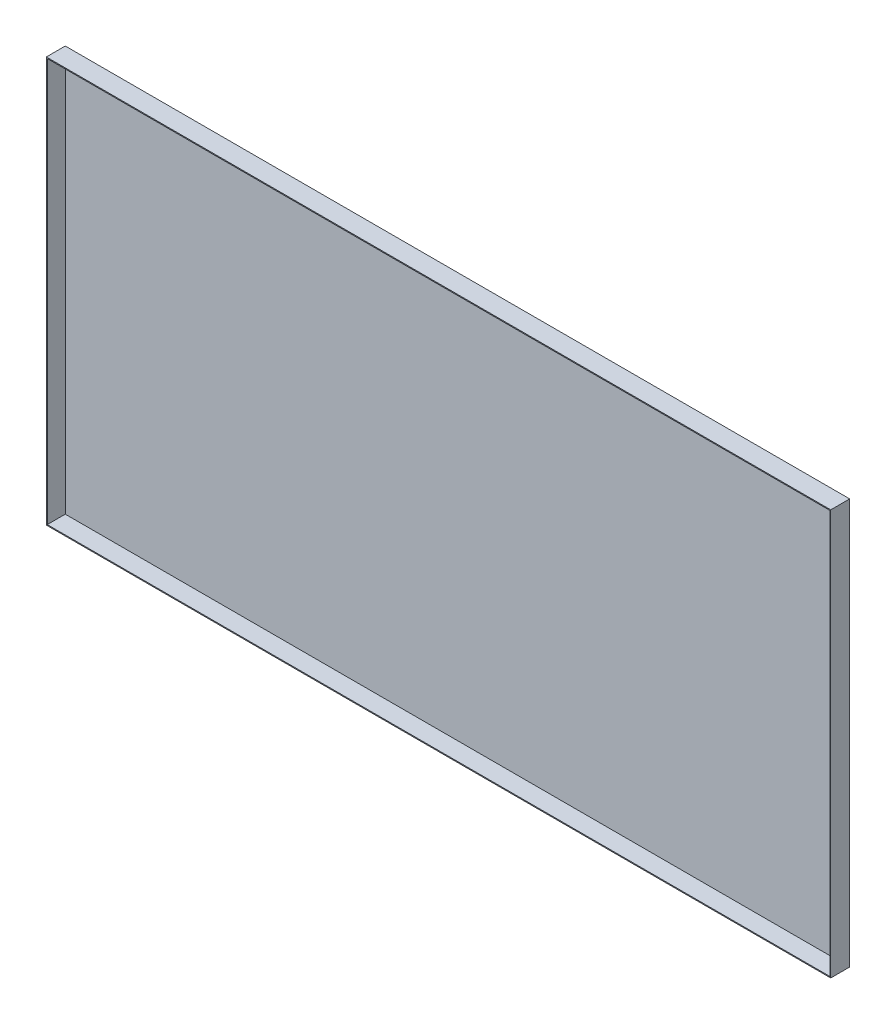
ISO-10303-21;
HEADER;
FILE_DESCRIPTION(('STEP AP214'),'2;1');
FILE_NAME('part.step','',(''),(''),'','','');
FILE_SCHEMA(('AUTOMOTIVE_DESIGN { 1 0 10303 214 1 1 1 1 }'));
ENDSEC;
DATA;
#1=APPLICATION_CONTEXT('core data for automotive mechanical design processes');
#2=APPLICATION_PROTOCOL_DEFINITION('international standard','automotive_design',2000,#1);
#3=PRODUCT_CONTEXT('',#1,'mechanical');
#4=PRODUCT('Part','Part','',(#3));
#5=PRODUCT_RELATED_PRODUCT_CATEGORY('part','',(#4));
#6=PRODUCT_DEFINITION_FORMATION('','',#4);
#7=PRODUCT_DEFINITION_CONTEXT('part definition',#1,'design');
#8=PRODUCT_DEFINITION('design','',#6,#7);
#9=PRODUCT_DEFINITION_SHAPE('','',#8);
#10=(LENGTH_UNIT() NAMED_UNIT(*) SI_UNIT(.MILLI.,.METRE.));
#11=(NAMED_UNIT(*) PLANE_ANGLE_UNIT() SI_UNIT($,.RADIAN.));
#12=(NAMED_UNIT(*) SI_UNIT($,.STERADIAN.) SOLID_ANGLE_UNIT());
#13=UNCERTAINTY_MEASURE_WITH_UNIT(LENGTH_MEASURE(1.E-05),#10,'distance_accuracy_value','');
#14=(GEOMETRIC_REPRESENTATION_CONTEXT(3) GLOBAL_UNCERTAINTY_ASSIGNED_CONTEXT((#13)) GLOBAL_UNIT_ASSIGNED_CONTEXT((#10,
#11,#12)) REPRESENTATION_CONTEXT('',''));
#15=CARTESIAN_POINT('',(0.,0.,0.));
#16=DIRECTION('',(0.,0.,1.));
#17=DIRECTION('',(1.,0.,0.));
#18=AXIS2_PLACEMENT_3D('',#15,#16,#17);
#19=CARTESIAN_POINT('',(414.,214.,20.));
#20=DIRECTION('',(-1.,0.,0.));
#21=DIRECTION('',(0.,-1.,0.));
#22=AXIS2_PLACEMENT_3D('',#19,#20,#21);
#23=PLANE('',#22);
#24=DIRECTION('',(0.,1.,0.));
#25=VECTOR('',#24,1.);
#26=CARTESIAN_POINT('',(414.,214.,0.));
#27=LINE('',#26,#25);
#28=CARTESIAN_POINT('',(414.,-214.,0.));
#29=VERTEX_POINT('',#28);
#30=CARTESIAN_POINT('',(414.,214.,0.));
#31=VERTEX_POINT('',#30);
#32=EDGE_CURVE('E167',#29,#31,#27,.T.);
#33=ORIENTED_EDGE('',*,*,#32,.T.);
#34=DIRECTION('',(0.,0.,-1.));
#35=VECTOR('',#34,1.);
#36=CARTESIAN_POINT('',(414.,214.,20.));
#37=LINE('',#36,#35);
#38=CARTESIAN_POINT('',(414.,214.,20.));
#39=VERTEX_POINT('',#38);
#40=EDGE_CURVE('E11',#39,#31,#37,.T.);
#41=ORIENTED_EDGE('',*,*,#40,.F.);
#42=DIRECTION('',(0.,1.,0.));
#43=VECTOR('',#42,1.);
#44=CARTESIAN_POINT('',(414.,214.,20.));
#45=LINE('',#44,#43);
#46=CARTESIAN_POINT('',(414.,-214.,20.));
#47=VERTEX_POINT('',#46);
#48=EDGE_CURVE('E156',#47,#39,#45,.T.);
#49=ORIENTED_EDGE('',*,*,#48,.F.);
#50=DIRECTION('',(0.,0.,-1.));
#51=VECTOR('',#50,1.);
#52=CARTESIAN_POINT('',(414.,-214.,20.));
#53=LINE('',#52,#51);
#54=EDGE_CURVE('E166',#47,#29,#53,.T.);
#55=ORIENTED_EDGE('',*,*,#54,.T.);
#56=EDGE_LOOP('',(#33,#41,#49,#55));
#57=FACE_BOUND('',#56,.T.);
#58=ADVANCED_FACE('F39',(#57),#23,.F.);
#59=CARTESIAN_POINT('',(-414.,214.,20.));
#60=DIRECTION('',(0.,-1.,0.));
#61=DIRECTION('',(0.,0.,-1.));
#62=AXIS2_PLACEMENT_3D('',#59,#60,#61);
#63=PLANE('',#62);
#64=DIRECTION('',(-1.,0.,0.));
#65=VECTOR('',#64,1.);
#66=CARTESIAN_POINT('',(-414.,214.,0.));
#67=LINE('',#66,#65);
#68=CARTESIAN_POINT('',(-414.,214.,0.));
#69=VERTEX_POINT('',#68);
#70=EDGE_CURVE('E171',#31,#69,#67,.T.);
#71=ORIENTED_EDGE('',*,*,#70,.T.);
#72=DIRECTION('',(0.,0.,-1.));
#73=VECTOR('',#72,1.);
#74=CARTESIAN_POINT('',(-414.,214.,20.));
#75=LINE('',#74,#73);
#76=CARTESIAN_POINT('',(-414.,214.,20.));
#77=VERTEX_POINT('',#76);
#78=EDGE_CURVE('E47',#77,#69,#75,.T.);
#79=ORIENTED_EDGE('',*,*,#78,.F.);
#80=DIRECTION('',(-1.,0.,0.));
#81=VECTOR('',#80,1.);
#82=CARTESIAN_POINT('',(-414.,214.,20.));
#83=LINE('',#82,#81);
#84=EDGE_CURVE('E91',#39,#77,#83,.T.);
#85=ORIENTED_EDGE('',*,*,#84,.F.);
#86=ORIENTED_EDGE('',*,*,#40,.T.);
#87=EDGE_LOOP('',(#71,#79,#85,#86));
#88=FACE_BOUND('',#87,.T.);
#89=ADVANCED_FACE('F206',(#88),#63,.F.);
#90=CARTESIAN_POINT('',(-414.,214.,20.));
#91=DIRECTION('',(1.,0.,0.));
#92=DIRECTION('',(0.,1.,0.));
#93=AXIS2_PLACEMENT_3D('',#90,#91,#92);
#94=PLANE('',#93);
#95=DIRECTION('',(0.,-1.,0.));
#96=VECTOR('',#95,1.);
#97=CARTESIAN_POINT('',(-414.,214.,0.));
#98=LINE('',#97,#96);
#99=CARTESIAN_POINT('',(-414.,-214.,0.));
#100=VERTEX_POINT('',#99);
#101=EDGE_CURVE('E174',#69,#100,#98,.T.);
#102=ORIENTED_EDGE('',*,*,#101,.T.);
#103=DIRECTION('',(0.,0.,-1.));
#104=VECTOR('',#103,1.);
#105=CARTESIAN_POINT('',(-414.,-214.,20.));
#106=LINE('',#105,#104);
#107=CARTESIAN_POINT('',(-414.,-214.,20.));
#108=VERTEX_POINT('',#107);
#109=EDGE_CURVE('E181',#108,#100,#106,.T.);
#110=ORIENTED_EDGE('',*,*,#109,.F.);
#111=DIRECTION('',(0.,-1.,0.));
#112=VECTOR('',#111,1.);
#113=CARTESIAN_POINT('',(-414.,214.,20.));
#114=LINE('',#113,#112);
#115=EDGE_CURVE('E161',#77,#108,#114,.T.);
#116=ORIENTED_EDGE('',*,*,#115,.F.);
#117=ORIENTED_EDGE('',*,*,#78,.T.);
#118=EDGE_LOOP('',(#102,#110,#116,#117));
#119=FACE_BOUND('',#118,.T.);
#120=ADVANCED_FACE('F188',(#119),#94,.F.);
#121=CARTESIAN_POINT('',(-414.,-214.,20.));
#122=DIRECTION('',(0.,1.,0.));
#123=DIRECTION('',(0.,0.,1.));
#124=AXIS2_PLACEMENT_3D('',#121,#122,#123);
#125=PLANE('',#124);
#126=DIRECTION('',(1.,0.,0.));
#127=VECTOR('',#126,1.);
#128=CARTESIAN_POINT('',(-414.,-214.,0.));
#129=LINE('',#128,#127);
#130=EDGE_CURVE('E84',#100,#29,#129,.T.);
#131=ORIENTED_EDGE('',*,*,#130,.T.);
#132=ORIENTED_EDGE('',*,*,#54,.F.);
#133=DIRECTION('',(1.,0.,0.));
#134=VECTOR('',#133,1.);
#135=CARTESIAN_POINT('',(-414.,-214.,20.));
#136=LINE('',#135,#134);
#137=EDGE_CURVE('E63',#108,#47,#136,.T.);
#138=ORIENTED_EDGE('',*,*,#137,.F.);
#139=ORIENTED_EDGE('',*,*,#109,.T.);
#140=EDGE_LOOP('',(#131,#132,#138,#139));
#141=FACE_BOUND('',#140,.T.);
#142=ADVANCED_FACE('F196',(#141),#125,.F.);
#143=CARTESIAN_POINT('',(0.,0.,20.));
#144=DIRECTION('',(0.,0.,1.));
#145=DIRECTION('',(1.,0.,0.));
#146=AXIS2_PLACEMENT_3D('',#143,#144,#145);
#147=PLANE('',#146);
#148=DIRECTION('',(0.,1.,0.));
#149=VECTOR('',#148,1.);
#150=CARTESIAN_POINT('',(413.,214.,20.));
#151=LINE('',#150,#149);
#152=CARTESIAN_POINT('',(413.,-213.,20.));
#153=VERTEX_POINT('',#152);
#154=CARTESIAN_POINT('',(413.,213.,20.));
#155=VERTEX_POINT('',#154);
#156=EDGE_CURVE('E140',#153,#155,#151,.T.);
#157=ORIENTED_EDGE('',*,*,#156,.F.);
#158=DIRECTION('',(1.,0.,0.));
#159=VECTOR('',#158,1.);
#160=CARTESIAN_POINT('',(-414.,-213.,20.));
#161=LINE('',#160,#159);
#162=CARTESIAN_POINT('',(-413.,-213.,20.));
#163=VERTEX_POINT('',#162);
#164=EDGE_CURVE('E153',#163,#153,#161,.T.);
#165=ORIENTED_EDGE('',*,*,#164,.F.);
#166=DIRECTION('',(0.,-1.,0.));
#167=VECTOR('',#166,1.);
#168=CARTESIAN_POINT('',(-413.,214.,20.));
#169=LINE('',#168,#167);
#170=CARTESIAN_POINT('',(-413.,213.,20.));
#171=VERTEX_POINT('',#170);
#172=EDGE_CURVE('E150',#171,#163,#169,.T.);
#173=ORIENTED_EDGE('',*,*,#172,.F.);
#174=DIRECTION('',(-1.,0.,0.));
#175=VECTOR('',#174,1.);
#176=CARTESIAN_POINT('',(-414.,213.,20.));
#177=LINE('',#176,#175);
#178=EDGE_CURVE('E129',#155,#171,#177,.T.);
#179=ORIENTED_EDGE('',*,*,#178,.F.);
#180=EDGE_LOOP('',(#157,#165,#173,#179));
#181=FACE_BOUND('',#180,.T.);
#182=ORIENTED_EDGE('',*,*,#48,.T.);
#183=ORIENTED_EDGE('',*,*,#84,.T.);
#184=ORIENTED_EDGE('',*,*,#115,.T.);
#185=ORIENTED_EDGE('',*,*,#137,.T.);
#186=EDGE_LOOP('',(#182,#183,#184,#185));
#187=FACE_BOUND('',#186,.T.);
#188=ADVANCED_FACE('F198',(#181,#187),#147,.T.);
#189=CARTESIAN_POINT('',(0.,0.,0.));
#190=DIRECTION('',(0.,0.,1.));
#191=DIRECTION('',(1.,0.,0.));
#192=AXIS2_PLACEMENT_3D('',#189,#190,#191);
#193=PLANE('',#192);
#194=ORIENTED_EDGE('',*,*,#32,.F.);
#195=ORIENTED_EDGE('',*,*,#130,.F.);
#196=ORIENTED_EDGE('',*,*,#101,.F.);
#197=ORIENTED_EDGE('',*,*,#70,.F.);
#198=EDGE_LOOP('',(#194,#195,#196,#197));
#199=FACE_BOUND('',#198,.T.);
#200=ADVANCED_FACE('F192',(#199),#193,.F.);
#201=CARTESIAN_POINT('',(413.,214.,20.));
#202=DIRECTION('',(-1.,0.,0.));
#203=DIRECTION('',(0.,-1.,0.));
#204=AXIS2_PLACEMENT_3D('',#201,#202,#203);
#205=PLANE('',#204);
#206=DIRECTION('',(0.,1.,0.));
#207=VECTOR('',#206,1.);
#208=CARTESIAN_POINT('',(413.,214.,1.));
#209=LINE('',#208,#207);
#210=CARTESIAN_POINT('',(413.,-213.,1.));
#211=VERTEX_POINT('',#210);
#212=CARTESIAN_POINT('',(413.,213.,1.));
#213=VERTEX_POINT('',#212);
#214=EDGE_CURVE('E119',#211,#213,#209,.T.);
#215=ORIENTED_EDGE('',*,*,#214,.F.);
#216=DIRECTION('',(0.,0.,-1.));
#217=VECTOR('',#216,1.);
#218=CARTESIAN_POINT('',(413.,-213.,20.));
#219=LINE('',#218,#217);
#220=EDGE_CURVE('E144',#153,#211,#219,.T.);
#221=ORIENTED_EDGE('',*,*,#220,.F.);
#222=ORIENTED_EDGE('',*,*,#156,.T.);
#223=DIRECTION('',(0.,0.,-1.));
#224=VECTOR('',#223,1.);
#225=CARTESIAN_POINT('',(413.,213.,20.));
#226=LINE('',#225,#224);
#227=EDGE_CURVE('E133',#155,#213,#226,.T.);
#228=ORIENTED_EDGE('',*,*,#227,.T.);
#229=EDGE_LOOP('',(#215,#221,#222,#228));
#230=FACE_BOUND('',#229,.T.);
#231=ADVANCED_FACE('F233',(#230),#205,.T.);
#232=CARTESIAN_POINT('',(-414.,213.,20.));
#233=DIRECTION('',(0.,-1.,0.));
#234=DIRECTION('',(0.,0.,-1.));
#235=AXIS2_PLACEMENT_3D('',#232,#233,#234);
#236=PLANE('',#235);
#237=DIRECTION('',(-1.,0.,0.));
#238=VECTOR('',#237,1.);
#239=CARTESIAN_POINT('',(-414.,213.,1.));
#240=LINE('',#239,#238);
#241=CARTESIAN_POINT('',(-413.,213.,1.));
#242=VERTEX_POINT('',#241);
#243=EDGE_CURVE('E113',#213,#242,#240,.T.);
#244=ORIENTED_EDGE('',*,*,#243,.F.);
#245=ORIENTED_EDGE('',*,*,#227,.F.);
#246=ORIENTED_EDGE('',*,*,#178,.T.);
#247=DIRECTION('',(0.,0.,-1.));
#248=VECTOR('',#247,1.);
#249=CARTESIAN_POINT('',(-413.,213.,20.));
#250=LINE('',#249,#248);
#251=EDGE_CURVE('E126',#171,#242,#250,.T.);
#252=ORIENTED_EDGE('',*,*,#251,.T.);
#253=EDGE_LOOP('',(#244,#245,#246,#252));
#254=FACE_BOUND('',#253,.T.);
#255=ADVANCED_FACE('F127',(#254),#236,.T.);
#256=CARTESIAN_POINT('',(-413.,214.,20.));
#257=DIRECTION('',(1.,0.,0.));
#258=DIRECTION('',(0.,1.,0.));
#259=AXIS2_PLACEMENT_3D('',#256,#257,#258);
#260=PLANE('',#259);
#261=DIRECTION('',(0.,-1.,0.));
#262=VECTOR('',#261,1.);
#263=CARTESIAN_POINT('',(-413.,214.,1.));
#264=LINE('',#263,#262);
#265=CARTESIAN_POINT('',(-413.,-213.,1.));
#266=VERTEX_POINT('',#265);
#267=EDGE_CURVE('E117',#242,#266,#264,.T.);
#268=ORIENTED_EDGE('',*,*,#267,.F.);
#269=ORIENTED_EDGE('',*,*,#251,.F.);
#270=ORIENTED_EDGE('',*,*,#172,.T.);
#271=DIRECTION('',(0.,0.,-1.));
#272=VECTOR('',#271,1.);
#273=CARTESIAN_POINT('',(-413.,-213.,20.));
#274=LINE('',#273,#272);
#275=EDGE_CURVE('E54',#163,#266,#274,.T.);
#276=ORIENTED_EDGE('',*,*,#275,.T.);
#277=EDGE_LOOP('',(#268,#269,#270,#276));
#278=FACE_BOUND('',#277,.T.);
#279=ADVANCED_FACE('F135',(#278),#260,.T.);
#280=CARTESIAN_POINT('',(-414.,-213.,20.));
#281=DIRECTION('',(0.,1.,0.));
#282=DIRECTION('',(0.,0.,1.));
#283=AXIS2_PLACEMENT_3D('',#280,#281,#282);
#284=PLANE('',#283);
#285=DIRECTION('',(1.,0.,0.));
#286=VECTOR('',#285,1.);
#287=CARTESIAN_POINT('',(-414.,-213.,1.));
#288=LINE('',#287,#286);
#289=EDGE_CURVE('E137',#266,#211,#288,.T.);
#290=ORIENTED_EDGE('',*,*,#289,.F.);
#291=ORIENTED_EDGE('',*,*,#275,.F.);
#292=ORIENTED_EDGE('',*,*,#164,.T.);
#293=ORIENTED_EDGE('',*,*,#220,.T.);
#294=EDGE_LOOP('',(#290,#291,#292,#293));
#295=FACE_BOUND('',#294,.T.);
#296=ADVANCED_FACE('F263',(#295),#284,.T.);
#297=CARTESIAN_POINT('',(0.,0.,1.));
#298=DIRECTION('',(0.,0.,1.));
#299=DIRECTION('',(1.,0.,0.));
#300=AXIS2_PLACEMENT_3D('',#297,#298,#299);
#301=PLANE('',#300);
#302=ORIENTED_EDGE('',*,*,#214,.T.);
#303=ORIENTED_EDGE('',*,*,#243,.T.);
#304=ORIENTED_EDGE('',*,*,#267,.T.);
#305=ORIENTED_EDGE('',*,*,#289,.T.);
#306=EDGE_LOOP('',(#302,#303,#304,#305));
#307=FACE_BOUND('',#306,.T.);
#308=ADVANCED_FACE('F115',(#307),#301,.T.);
#309=CLOSED_SHELL('',(#58,#89,#120,#142,#188,#200,#231,#255,#279,#296,#308));
#310=MANIFOLD_SOLID_BREP('B2',#309);
#311=ADVANCED_BREP_SHAPE_REPRESENTATION('',(#18,#310),#14);
#312=SHAPE_DEFINITION_REPRESENTATION(#9,#311);
ENDSEC;
END-ISO-10303-21;
